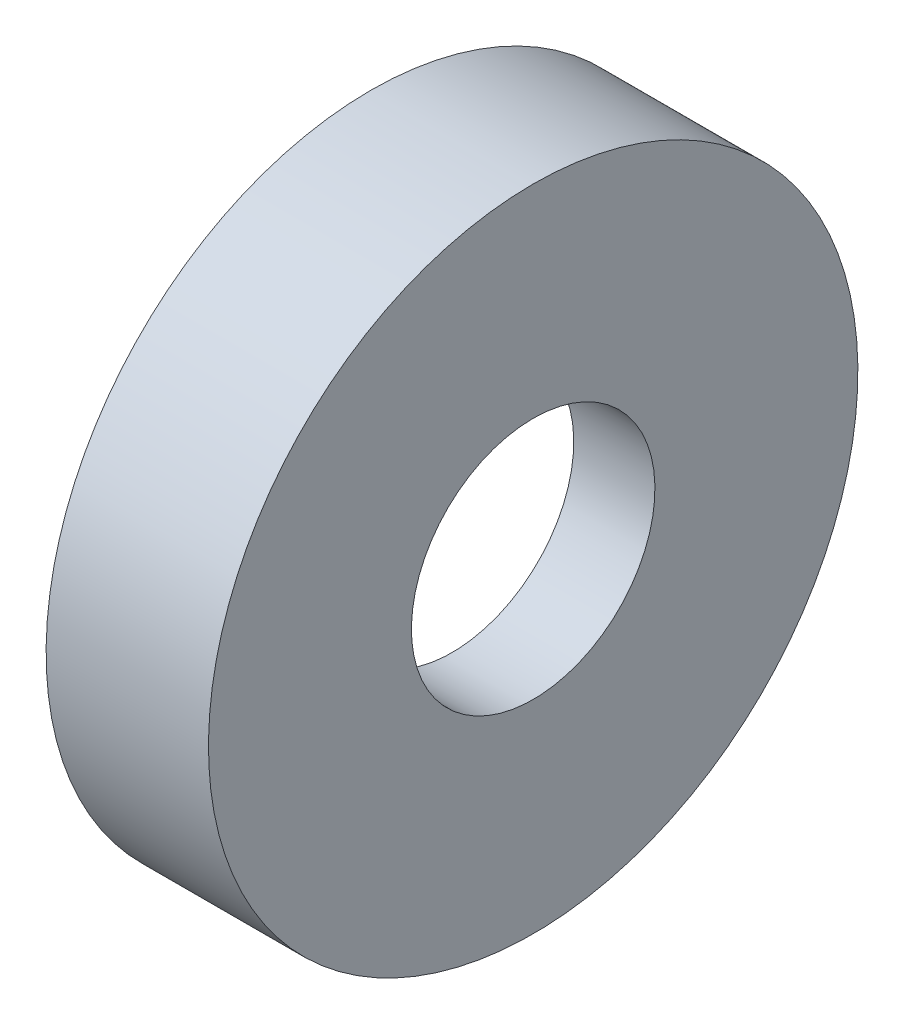
ISO-10303-21;
HEADER;
FILE_DESCRIPTION(('STEP AP214'),'2;1');
FILE_NAME('part.step','',(''),(''),'','','');
FILE_SCHEMA(('AUTOMOTIVE_DESIGN { 1 0 10303 214 1 1 1 1 }'));
ENDSEC;
DATA;
#1=APPLICATION_CONTEXT('core data for automotive mechanical design processes');
#2=APPLICATION_PROTOCOL_DEFINITION('international standard','automotive_design',2000,#1);
#3=PRODUCT_CONTEXT('',#1,'mechanical');
#4=PRODUCT('Part','Part','',(#3));
#5=PRODUCT_RELATED_PRODUCT_CATEGORY('part','',(#4));
#6=PRODUCT_DEFINITION_FORMATION('','',#4);
#7=PRODUCT_DEFINITION_CONTEXT('part definition',#1,'design');
#8=PRODUCT_DEFINITION('design','',#6,#7);
#9=PRODUCT_DEFINITION_SHAPE('','',#8);
#10=(LENGTH_UNIT() NAMED_UNIT(*) SI_UNIT(.MILLI.,.METRE.));
#11=(NAMED_UNIT(*) PLANE_ANGLE_UNIT() SI_UNIT($,.RADIAN.));
#12=(NAMED_UNIT(*) SI_UNIT($,.STERADIAN.) SOLID_ANGLE_UNIT());
#13=UNCERTAINTY_MEASURE_WITH_UNIT(LENGTH_MEASURE(1.E-05),#10,'distance_accuracy_value','');
#14=(GEOMETRIC_REPRESENTATION_CONTEXT(3) GLOBAL_UNCERTAINTY_ASSIGNED_CONTEXT((#13)) GLOBAL_UNIT_ASSIGNED_CONTEXT((#10,
#11,#12)) REPRESENTATION_CONTEXT('',''));
#15=CARTESIAN_POINT('',(0.,0.,0.));
#16=DIRECTION('',(0.,0.,1.));
#17=DIRECTION('',(1.,0.,0.));
#18=AXIS2_PLACEMENT_3D('',#15,#16,#17);
#19=CARTESIAN_POINT('',(-3.175,12.7,0.));
#20=DIRECTION('',(-1.,0.,0.));
#21=DIRECTION('',(0.,-1.,0.));
#22=AXIS2_PLACEMENT_3D('',#19,#20,#21);
#23=PLANE('',#22);
#24=CARTESIAN_POINT('',(-3.175,0.,0.));
#25=DIRECTION('',(1.,0.,0.));
#26=DIRECTION('',(0.,1.,0.));
#27=AXIS2_PLACEMENT_3D('',#24,#25,#26);
#28=CIRCLE('',#27,11.1125);
#29=CARTESIAN_POINT('',(-3.175,11.1125,0.));
#30=VERTEX_POINT('',#29);
#31=EDGE_CURVE('E10',#30,#30,#28,.T.);
#32=ORIENTED_EDGE('',*,*,#31,.T.);
#33=EDGE_LOOP('',(#32));
#34=FACE_BOUND('',#33,.T.);
#35=CARTESIAN_POINT('',(-3.175,0.,0.));
#36=DIRECTION('',(1.,0.,0.));
#37=DIRECTION('',(0.,1.,0.));
#38=AXIS2_PLACEMENT_3D('',#35,#36,#37);
#39=CIRCLE('',#38,12.7);
#40=CARTESIAN_POINT('',(-3.175,12.7,0.));
#41=VERTEX_POINT('',#40);
#42=EDGE_CURVE('E53',#41,#41,#39,.T.);
#43=ORIENTED_EDGE('',*,*,#42,.F.);
#44=EDGE_LOOP('',(#43));
#45=FACE_BOUND('',#44,.T.);
#46=ADVANCED_FACE('F31',(#34,#45),#23,.T.);
#47=CARTESIAN_POINT('',(3.175,0.,0.));
#48=DIRECTION('',(1.,0.,0.));
#49=DIRECTION('',(0.,1.,0.));
#50=AXIS2_PLACEMENT_3D('',#47,#48,#49);
#51=CYLINDRICAL_SURFACE('',#50,11.1125);
#52=CARTESIAN_POINT('',(0.,0.,0.));
#53=DIRECTION('',(1.,0.,0.));
#54=DIRECTION('',(0.,1.,0.));
#55=AXIS2_PLACEMENT_3D('',#52,#53,#54);
#56=CIRCLE('',#55,11.1125);
#57=CARTESIAN_POINT('',(0.,11.1125,0.));
#58=VERTEX_POINT('',#57);
#59=EDGE_CURVE('E37',#58,#58,#56,.T.);
#60=ORIENTED_EDGE('',*,*,#59,.T.);
#61=EDGE_LOOP('',(#60));
#62=FACE_BOUND('',#61,.T.);
#63=ORIENTED_EDGE('',*,*,#31,.F.);
#64=EDGE_LOOP('',(#63));
#65=FACE_BOUND('',#64,.T.);
#66=ADVANCED_FACE('F61',(#62,#65),#51,.F.);
#67=CARTESIAN_POINT('',(0.,11.1125,0.));
#68=DIRECTION('',(-1.,0.,0.));
#69=DIRECTION('',(0.,-1.,0.));
#70=AXIS2_PLACEMENT_3D('',#67,#68,#69);
#71=PLANE('',#70);
#72=CARTESIAN_POINT('',(0.,0.,0.));
#73=DIRECTION('',(1.,0.,0.));
#74=DIRECTION('',(0.,1.,0.));
#75=AXIS2_PLACEMENT_3D('',#72,#73,#74);
#76=CIRCLE('',#75,4.7625);
#77=CARTESIAN_POINT('',(0.,4.7625,0.));
#78=VERTEX_POINT('',#77);
#79=EDGE_CURVE('E41',#78,#78,#76,.T.);
#80=ORIENTED_EDGE('',*,*,#79,.T.);
#81=EDGE_LOOP('',(#80));
#82=FACE_BOUND('',#81,.T.);
#83=ORIENTED_EDGE('',*,*,#59,.F.);
#84=EDGE_LOOP('',(#83));
#85=FACE_BOUND('',#84,.T.);
#86=ADVANCED_FACE('F65',(#82,#85),#71,.T.);
#87=CARTESIAN_POINT('',(3.175,0.,0.));
#88=DIRECTION('',(1.,0.,0.));
#89=DIRECTION('',(0.,1.,0.));
#90=AXIS2_PLACEMENT_3D('',#87,#88,#89);
#91=CYLINDRICAL_SURFACE('',#90,4.7625);
#92=CARTESIAN_POINT('',(3.175,0.,0.));
#93=DIRECTION('',(1.,0.,0.));
#94=DIRECTION('',(0.,1.,0.));
#95=AXIS2_PLACEMENT_3D('',#92,#93,#94);
#96=CIRCLE('',#95,4.7625);
#97=CARTESIAN_POINT('',(3.175,4.7625,0.));
#98=VERTEX_POINT('',#97);
#99=EDGE_CURVE('E45',#98,#98,#96,.T.);
#100=ORIENTED_EDGE('',*,*,#99,.T.);
#101=EDGE_LOOP('',(#100));
#102=FACE_BOUND('',#101,.T.);
#103=ORIENTED_EDGE('',*,*,#79,.F.);
#104=EDGE_LOOP('',(#103));
#105=FACE_BOUND('',#104,.T.);
#106=ADVANCED_FACE('F69',(#102,#105),#91,.F.);
#107=CARTESIAN_POINT('',(3.17499999999999,12.7,0.));
#108=DIRECTION('',(1.,0.,0.));
#109=DIRECTION('',(0.,1.,0.));
#110=AXIS2_PLACEMENT_3D('',#107,#108,#109);
#111=PLANE('',#110);
#112=CARTESIAN_POINT('',(3.175,0.,0.));
#113=DIRECTION('',(1.,0.,0.));
#114=DIRECTION('',(0.,1.,0.));
#115=AXIS2_PLACEMENT_3D('',#112,#113,#114);
#116=CIRCLE('',#115,12.7);
#117=CARTESIAN_POINT('',(3.17499999999999,12.7,0.));
#118=VERTEX_POINT('',#117);
#119=EDGE_CURVE('E50',#118,#118,#116,.T.);
#120=ORIENTED_EDGE('',*,*,#119,.T.);
#121=EDGE_LOOP('',(#120));
#122=FACE_BOUND('',#121,.T.);
#123=ORIENTED_EDGE('',*,*,#99,.F.);
#124=EDGE_LOOP('',(#123));
#125=FACE_BOUND('',#124,.T.);
#126=ADVANCED_FACE('F76',(#122,#125),#111,.T.);
#127=CARTESIAN_POINT('',(3.175,0.,0.));
#128=DIRECTION('',(1.,0.,0.));
#129=DIRECTION('',(0.,1.,0.));
#130=AXIS2_PLACEMENT_3D('',#127,#128,#129);
#131=CYLINDRICAL_SURFACE('',#130,12.7);
#132=ORIENTED_EDGE('',*,*,#42,.T.);
#133=EDGE_LOOP('',(#132));
#134=FACE_BOUND('',#133,.T.);
#135=ORIENTED_EDGE('',*,*,#119,.F.);
#136=EDGE_LOOP('',(#135));
#137=FACE_BOUND('',#136,.T.);
#138=ADVANCED_FACE('F57',(#134,#137),#131,.T.);
#139=CLOSED_SHELL('',(#46,#66,#86,#106,#126,#138));
#140=MANIFOLD_SOLID_BREP('B2',#139);
#141=ADVANCED_BREP_SHAPE_REPRESENTATION('',(#18,#140),#14);
#142=SHAPE_DEFINITION_REPRESENTATION(#9,#141);
ENDSEC;
END-ISO-10303-21;
